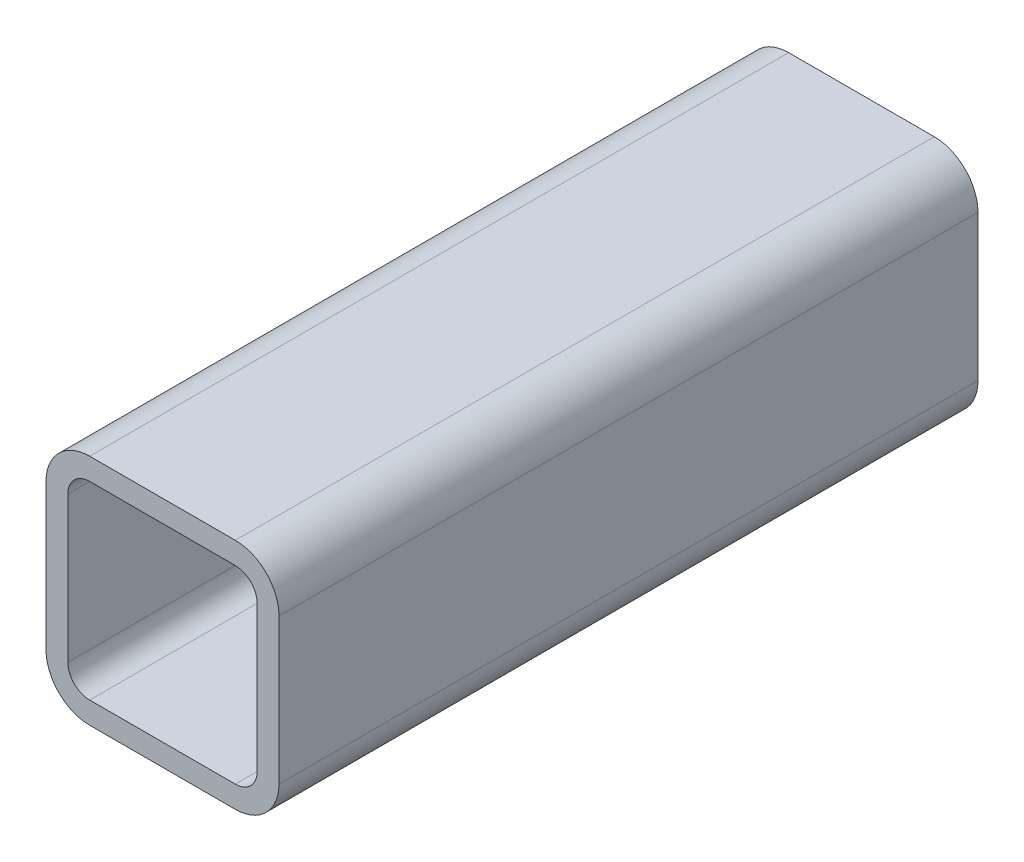
ISO-10303-21;
HEADER;
FILE_DESCRIPTION(('STEP AP214'),'2;1');
FILE_NAME('part.step','',(''),(''),'','','');
FILE_SCHEMA(('AUTOMOTIVE_DESIGN { 1 0 10303 214 1 1 1 1 }'));
ENDSEC;
DATA;
#1=APPLICATION_CONTEXT('core data for automotive mechanical design processes');
#2=APPLICATION_PROTOCOL_DEFINITION('international standard','automotive_design',2000,#1);
#3=PRODUCT_CONTEXT('',#1,'mechanical');
#4=PRODUCT('Part','Part','',(#3));
#5=PRODUCT_RELATED_PRODUCT_CATEGORY('part','',(#4));
#6=PRODUCT_DEFINITION_FORMATION('','',#4);
#7=PRODUCT_DEFINITION_CONTEXT('part definition',#1,'design');
#8=PRODUCT_DEFINITION('design','',#6,#7);
#9=PRODUCT_DEFINITION_SHAPE('','',#8);
#10=(LENGTH_UNIT() NAMED_UNIT(*) SI_UNIT(.MILLI.,.METRE.));
#11=(NAMED_UNIT(*) PLANE_ANGLE_UNIT() SI_UNIT($,.RADIAN.));
#12=(NAMED_UNIT(*) SI_UNIT($,.STERADIAN.) SOLID_ANGLE_UNIT());
#13=UNCERTAINTY_MEASURE_WITH_UNIT(LENGTH_MEASURE(1.E-05),#10,'distance_accuracy_value','');
#14=(GEOMETRIC_REPRESENTATION_CONTEXT(3) GLOBAL_UNCERTAINTY_ASSIGNED_CONTEXT((#13)) GLOBAL_UNIT_ASSIGNED_CONTEXT((#10,
#11,#12)) REPRESENTATION_CONTEXT('',''));
#15=CARTESIAN_POINT('',(0.,0.,0.));
#16=DIRECTION('',(0.,0.,1.));
#17=DIRECTION('',(1.,0.,0.));
#18=AXIS2_PLACEMENT_3D('',#15,#16,#17);
#19=CARTESIAN_POINT('',(41.27496425,41.27496425,76.2));
#20=DIRECTION('',(0.,0.,1.));
#21=DIRECTION('',(1.,0.,0.));
#22=AXIS2_PLACEMENT_3D('',#19,#20,#21);
#23=PLANE('',#22);
#24=CARTESIAN_POINT('',(41.27496425,41.27496425,76.2));
#25=DIRECTION('',(0.,0.,1.));
#26=DIRECTION('',(1.,0.,0.));
#27=AXIS2_PLACEMENT_3D('',#24,#25,#26);
#28=CIRCLE('',#27,9.52499175);
#29=CARTESIAN_POINT('',(50.799956,41.27496425,76.2));
#30=VERTEX_POINT('',#29);
#31=CARTESIAN_POINT('',(41.27496425,50.799956,76.2));
#32=VERTEX_POINT('',#31);
#33=EDGE_CURVE('E210',#30,#32,#28,.T.);
#34=ORIENTED_EDGE('',*,*,#33,.T.);
#35=DIRECTION('',(-1.,0.,0.));
#36=VECTOR('',#35,1.);
#37=CARTESIAN_POINT('',(41.27496425,50.799956,76.2));
#38=LINE('',#37,#36);
#39=CARTESIAN_POINT('',(9.52499174999999,50.799956,76.2));
#40=VERTEX_POINT('',#39);
#41=EDGE_CURVE('E213',#32,#40,#38,.T.);
#42=ORIENTED_EDGE('',*,*,#41,.T.);
#43=CARTESIAN_POINT('',(9.52499174999999,41.27496425,76.2));
#44=DIRECTION('',(0.,0.,1.));
#45=DIRECTION('',(1.,0.,0.));
#46=AXIS2_PLACEMENT_3D('',#43,#44,#45);
#47=CIRCLE('',#46,9.52499175);
#48=CARTESIAN_POINT('',(0.,41.27496425,76.2));
#49=VERTEX_POINT('',#48);
#50=EDGE_CURVE('E216',#40,#49,#47,.T.);
#51=ORIENTED_EDGE('',*,*,#50,.T.);
#52=DIRECTION('',(0.,-1.,0.));
#53=VECTOR('',#52,1.);
#54=CARTESIAN_POINT('',(0.,9.52499175,76.2));
#55=LINE('',#54,#53);
#56=CARTESIAN_POINT('',(0.,9.52499175,76.2));
#57=VERTEX_POINT('',#56);
#58=EDGE_CURVE('E218',#49,#57,#55,.T.);
#59=ORIENTED_EDGE('',*,*,#58,.T.);
#60=CARTESIAN_POINT('',(9.52499175,9.52499175,76.2));
#61=DIRECTION('',(0.,0.,1.));
#62=DIRECTION('',(1.,0.,0.));
#63=AXIS2_PLACEMENT_3D('',#60,#61,#62);
#64=CIRCLE('',#63,9.52499175);
#65=CARTESIAN_POINT('',(9.52499175,0.,76.2));
#66=VERTEX_POINT('',#65);
#67=EDGE_CURVE('E220',#57,#66,#64,.T.);
#68=ORIENTED_EDGE('',*,*,#67,.T.);
#69=DIRECTION('',(1.,0.,0.));
#70=VECTOR('',#69,1.);
#71=CARTESIAN_POINT('',(9.52499175,0.,76.2));
#72=LINE('',#71,#70);
#73=CARTESIAN_POINT('',(41.27496425,0.,76.2));
#74=VERTEX_POINT('',#73);
#75=EDGE_CURVE('E222',#66,#74,#72,.T.);
#76=ORIENTED_EDGE('',*,*,#75,.T.);
#77=CARTESIAN_POINT('',(41.27496425,9.52499175,76.2));
#78=DIRECTION('',(0.,0.,1.));
#79=DIRECTION('',(1.,0.,0.));
#80=AXIS2_PLACEMENT_3D('',#77,#78,#79);
#81=CIRCLE('',#80,9.52499175);
#82=CARTESIAN_POINT('',(50.799956,9.52499175,76.2));
#83=VERTEX_POINT('',#82);
#84=EDGE_CURVE('E224',#74,#83,#81,.T.);
#85=ORIENTED_EDGE('',*,*,#84,.T.);
#86=DIRECTION('',(0.,1.,0.));
#87=VECTOR('',#86,1.);
#88=CARTESIAN_POINT('',(50.799956,41.27496425,76.2));
#89=LINE('',#88,#87);
#90=EDGE_CURVE('E226',#83,#30,#89,.T.);
#91=ORIENTED_EDGE('',*,*,#90,.T.);
#92=EDGE_LOOP('',(#34,#42,#51,#59,#68,#76,#85,#91));
#93=FACE_BOUND('',#92,.T.);
#94=DIRECTION('',(0.,-1.,0.));
#95=VECTOR('',#94,1.);
#96=CARTESIAN_POINT('',(4.762495875,9.52499175,76.2));
#97=LINE('',#96,#95);
#98=CARTESIAN_POINT('',(4.76249587499999,41.27496425,76.2));
#99=VERTEX_POINT('',#98);
#100=CARTESIAN_POINT('',(4.762495875,9.52499175,76.2));
#101=VERTEX_POINT('',#100);
#102=EDGE_CURVE('E153',#99,#101,#97,.T.);
#103=ORIENTED_EDGE('',*,*,#102,.F.);
#104=CARTESIAN_POINT('',(9.52499174999999,41.27496425,76.2));
#105=DIRECTION('',(0.,0.,1.));
#106=DIRECTION('',(1.,0.,0.));
#107=AXIS2_PLACEMENT_3D('',#104,#105,#106);
#108=CIRCLE('',#107,4.762495875);
#109=CARTESIAN_POINT('',(9.52499174999999,46.037460125,76.2));
#110=VERTEX_POINT('',#109);
#111=EDGE_CURVE('E145',#110,#99,#108,.T.);
#112=ORIENTED_EDGE('',*,*,#111,.F.);
#113=DIRECTION('',(-1.,0.,0.));
#114=VECTOR('',#113,1.);
#115=CARTESIAN_POINT('',(41.27496425,46.037460125,76.2));
#116=LINE('',#115,#114);
#117=CARTESIAN_POINT('',(41.27496425,46.037460125,76.2));
#118=VERTEX_POINT('',#117);
#119=EDGE_CURVE('E178',#118,#110,#116,.T.);
#120=ORIENTED_EDGE('',*,*,#119,.F.);
#121=CARTESIAN_POINT('',(41.27496425,41.27496425,76.2));
#122=DIRECTION('',(0.,0.,1.));
#123=DIRECTION('',(1.,0.,0.));
#124=AXIS2_PLACEMENT_3D('',#121,#122,#123);
#125=CIRCLE('',#124,4.76249587500001);
#126=CARTESIAN_POINT('',(46.037460125,41.27496425,76.2));
#127=VERTEX_POINT('',#126);
#128=EDGE_CURVE('E176',#127,#118,#125,.T.);
#129=ORIENTED_EDGE('',*,*,#128,.F.);
#130=DIRECTION('',(0.,1.,0.));
#131=VECTOR('',#130,1.);
#132=CARTESIAN_POINT('',(46.037460125,41.27496425,76.2));
#133=LINE('',#132,#131);
#134=CARTESIAN_POINT('',(46.037460125,9.52499175,76.2));
#135=VERTEX_POINT('',#134);
#136=EDGE_CURVE('E174',#135,#127,#133,.T.);
#137=ORIENTED_EDGE('',*,*,#136,.F.);
#138=CARTESIAN_POINT('',(41.27496425,9.52499175,76.2));
#139=DIRECTION('',(0.,0.,1.));
#140=DIRECTION('',(1.,0.,0.));
#141=AXIS2_PLACEMENT_3D('',#138,#139,#140);
#142=CIRCLE('',#141,4.762495875);
#143=CARTESIAN_POINT('',(41.27496425,4.762495875,76.2));
#144=VERTEX_POINT('',#143);
#145=EDGE_CURVE('E172',#144,#135,#142,.T.);
#146=ORIENTED_EDGE('',*,*,#145,.F.);
#147=DIRECTION('',(1.,0.,0.));
#148=VECTOR('',#147,1.);
#149=CARTESIAN_POINT('',(9.52499175,4.762495875,76.2));
#150=LINE('',#149,#148);
#151=CARTESIAN_POINT('',(9.52499175,4.762495875,76.2));
#152=VERTEX_POINT('',#151);
#153=EDGE_CURVE('E168',#152,#144,#150,.T.);
#154=ORIENTED_EDGE('',*,*,#153,.F.);
#155=CARTESIAN_POINT('',(9.52499175,9.52499175,76.2));
#156=DIRECTION('',(0.,0.,1.));
#157=DIRECTION('',(1.,0.,0.));
#158=AXIS2_PLACEMENT_3D('',#155,#156,#157);
#159=CIRCLE('',#158,4.762495875);
#160=EDGE_CURVE('E166',#101,#152,#159,.T.);
#161=ORIENTED_EDGE('',*,*,#160,.F.);
#162=EDGE_LOOP('',(#103,#112,#120,#129,#137,#146,#154,#161));
#163=FACE_BOUND('',#162,.T.);
#164=ADVANCED_FACE('F32',(#93,#163),#23,.T.);
#165=CARTESIAN_POINT('',(41.27496425,41.27496425,-76.2));
#166=DIRECTION('',(0.,0.,1.));
#167=DIRECTION('',(1.,0.,0.));
#168=AXIS2_PLACEMENT_3D('',#165,#166,#167);
#169=PLANE('',#168);
#170=CARTESIAN_POINT('',(41.27496425,41.27496425,-76.2));
#171=DIRECTION('',(0.,0.,1.));
#172=DIRECTION('',(1.,0.,0.));
#173=AXIS2_PLACEMENT_3D('',#170,#171,#172);
#174=CIRCLE('',#173,9.52499175);
#175=CARTESIAN_POINT('',(50.799956,41.27496425,-76.2));
#176=VERTEX_POINT('',#175);
#177=CARTESIAN_POINT('',(41.27496425,50.799956,-76.2));
#178=VERTEX_POINT('',#177);
#179=EDGE_CURVE('E161',#176,#178,#174,.T.);
#180=ORIENTED_EDGE('',*,*,#179,.F.);
#181=DIRECTION('',(0.,1.,0.));
#182=VECTOR('',#181,1.);
#183=CARTESIAN_POINT('',(50.799956,41.27496425,-76.2));
#184=LINE('',#183,#182);
#185=CARTESIAN_POINT('',(50.799956,9.52499175,-76.2));
#186=VERTEX_POINT('',#185);
#187=EDGE_CURVE('E214',#186,#176,#184,.T.);
#188=ORIENTED_EDGE('',*,*,#187,.F.);
#189=CARTESIAN_POINT('',(41.27496425,9.52499175,-76.2));
#190=DIRECTION('',(0.,0.,1.));
#191=DIRECTION('',(1.,0.,0.));
#192=AXIS2_PLACEMENT_3D('',#189,#190,#191);
#193=CIRCLE('',#192,9.52499175);
#194=CARTESIAN_POINT('',(41.27496425,0.,-76.2));
#195=VERTEX_POINT('',#194);
#196=EDGE_CURVE('E241',#195,#186,#193,.T.);
#197=ORIENTED_EDGE('',*,*,#196,.F.);
#198=DIRECTION('',(1.,0.,0.));
#199=VECTOR('',#198,1.);
#200=CARTESIAN_POINT('',(9.52499175,0.,-76.2));
#201=LINE('',#200,#199);
#202=CARTESIAN_POINT('',(9.52499175,0.,-76.2));
#203=VERTEX_POINT('',#202);
#204=EDGE_CURVE('E239',#203,#195,#201,.T.);
#205=ORIENTED_EDGE('',*,*,#204,.F.);
#206=CARTESIAN_POINT('',(9.52499175,9.52499175,-76.2));
#207=DIRECTION('',(0.,0.,1.));
#208=DIRECTION('',(1.,0.,0.));
#209=AXIS2_PLACEMENT_3D('',#206,#207,#208);
#210=CIRCLE('',#209,9.52499175);
#211=CARTESIAN_POINT('',(0.,9.52499175,-76.2));
#212=VERTEX_POINT('',#211);
#213=EDGE_CURVE('E237',#212,#203,#210,.T.);
#214=ORIENTED_EDGE('',*,*,#213,.F.);
#215=DIRECTION('',(0.,-1.,0.));
#216=VECTOR('',#215,1.);
#217=CARTESIAN_POINT('',(0.,9.52499175,-76.2));
#218=LINE('',#217,#216);
#219=CARTESIAN_POINT('',(0.,41.27496425,-76.2));
#220=VERTEX_POINT('',#219);
#221=EDGE_CURVE('E235',#220,#212,#218,.T.);
#222=ORIENTED_EDGE('',*,*,#221,.F.);
#223=CARTESIAN_POINT('',(9.52499174999999,41.27496425,-76.2));
#224=DIRECTION('',(0.,0.,1.));
#225=DIRECTION('',(1.,0.,0.));
#226=AXIS2_PLACEMENT_3D('',#223,#224,#225);
#227=CIRCLE('',#226,9.52499175);
#228=CARTESIAN_POINT('',(9.52499174999999,50.799956,-76.2));
#229=VERTEX_POINT('',#228);
#230=EDGE_CURVE('E233',#229,#220,#227,.T.);
#231=ORIENTED_EDGE('',*,*,#230,.F.);
#232=DIRECTION('',(-1.,0.,0.));
#233=VECTOR('',#232,1.);
#234=CARTESIAN_POINT('',(41.27496425,50.799956,-76.2));
#235=LINE('',#234,#233);
#236=EDGE_CURVE('E231',#178,#229,#235,.T.);
#237=ORIENTED_EDGE('',*,*,#236,.F.);
#238=EDGE_LOOP('',(#180,#188,#197,#205,#214,#222,#231,#237));
#239=FACE_BOUND('',#238,.T.);
#240=CARTESIAN_POINT('',(9.52499174999999,41.27496425,-76.2));
#241=DIRECTION('',(0.,0.,1.));
#242=DIRECTION('',(1.,0.,0.));
#243=AXIS2_PLACEMENT_3D('',#240,#241,#242);
#244=CIRCLE('',#243,4.762495875);
#245=CARTESIAN_POINT('',(9.52499175,46.037460125,-76.2));
#246=VERTEX_POINT('',#245);
#247=CARTESIAN_POINT('',(4.76249587499999,41.27496425,-76.2));
#248=VERTEX_POINT('',#247);
#249=EDGE_CURVE('E55',#246,#248,#244,.T.);
#250=ORIENTED_EDGE('',*,*,#249,.T.);
#251=DIRECTION('',(0.,-1.,0.));
#252=VECTOR('',#251,1.);
#253=CARTESIAN_POINT('',(4.762495875,9.52499175,-76.2));
#254=LINE('',#253,#252);
#255=CARTESIAN_POINT('',(4.762495875,9.52499175,-76.2));
#256=VERTEX_POINT('',#255);
#257=EDGE_CURVE('E160',#248,#256,#254,.T.);
#258=ORIENTED_EDGE('',*,*,#257,.T.);
#259=CARTESIAN_POINT('',(9.52499175,9.52499175,-76.2));
#260=DIRECTION('',(0.,0.,1.));
#261=DIRECTION('',(1.,0.,0.));
#262=AXIS2_PLACEMENT_3D('',#259,#260,#261);
#263=CIRCLE('',#262,4.762495875);
#264=CARTESIAN_POINT('',(9.52499175,4.762495875,-76.2));
#265=VERTEX_POINT('',#264);
#266=EDGE_CURVE('E182',#256,#265,#263,.T.);
#267=ORIENTED_EDGE('',*,*,#266,.T.);
#268=DIRECTION('',(1.,0.,0.));
#269=VECTOR('',#268,1.);
#270=CARTESIAN_POINT('',(9.52499175,4.762495875,-76.2));
#271=LINE('',#270,#269);
#272=CARTESIAN_POINT('',(41.27496425,4.762495875,-76.2));
#273=VERTEX_POINT('',#272);
#274=EDGE_CURVE('E185',#265,#273,#271,.T.);
#275=ORIENTED_EDGE('',*,*,#274,.T.);
#276=CARTESIAN_POINT('',(41.27496425,9.52499175,-76.2));
#277=DIRECTION('',(0.,0.,1.));
#278=DIRECTION('',(1.,0.,0.));
#279=AXIS2_PLACEMENT_3D('',#276,#277,#278);
#280=CIRCLE('',#279,4.762495875);
#281=CARTESIAN_POINT('',(46.037460125,9.52499175,-76.2));
#282=VERTEX_POINT('',#281);
#283=EDGE_CURVE('E188',#273,#282,#280,.T.);
#284=ORIENTED_EDGE('',*,*,#283,.T.);
#285=DIRECTION('',(0.,1.,0.));
#286=VECTOR('',#285,1.);
#287=CARTESIAN_POINT('',(46.037460125,41.27496425,-76.2));
#288=LINE('',#287,#286);
#289=CARTESIAN_POINT('',(46.037460125,41.27496425,-76.2));
#290=VERTEX_POINT('',#289);
#291=EDGE_CURVE('E191',#282,#290,#288,.T.);
#292=ORIENTED_EDGE('',*,*,#291,.T.);
#293=CARTESIAN_POINT('',(41.27496425,41.27496425,-76.2));
#294=DIRECTION('',(0.,0.,1.));
#295=DIRECTION('',(1.,0.,0.));
#296=AXIS2_PLACEMENT_3D('',#293,#294,#295);
#297=CIRCLE('',#296,4.76249587500001);
#298=CARTESIAN_POINT('',(41.27496425,46.037460125,-76.2));
#299=VERTEX_POINT('',#298);
#300=EDGE_CURVE('E194',#290,#299,#297,.T.);
#301=ORIENTED_EDGE('',*,*,#300,.T.);
#302=DIRECTION('',(-1.,0.,0.));
#303=VECTOR('',#302,1.);
#304=CARTESIAN_POINT('',(41.27496425,46.037460125,-76.2));
#305=LINE('',#304,#303);
#306=EDGE_CURVE('E154',#299,#246,#305,.T.);
#307=ORIENTED_EDGE('',*,*,#306,.T.);
#308=EDGE_LOOP('',(#250,#258,#267,#275,#284,#292,#301,#307));
#309=FACE_BOUND('',#308,.T.);
#310=ADVANCED_FACE('F271',(#239,#309),#169,.F.);
#311=CARTESIAN_POINT('',(41.27496425,41.27496425,76.2));
#312=DIRECTION('',(0.,0.,-1.));
#313=DIRECTION('',(-1.,0.,0.));
#314=AXIS2_PLACEMENT_3D('',#311,#312,#313);
#315=CYLINDRICAL_SURFACE('',#314,9.52499175);
#316=ORIENTED_EDGE('',*,*,#179,.T.);
#317=DIRECTION('',(0.,0.,-1.));
#318=VECTOR('',#317,1.);
#319=CARTESIAN_POINT('',(41.27496425,50.799956,76.2));
#320=LINE('',#319,#318);
#321=EDGE_CURVE('E11',#32,#178,#320,.T.);
#322=ORIENTED_EDGE('',*,*,#321,.F.);
#323=ORIENTED_EDGE('',*,*,#33,.F.);
#324=DIRECTION('',(0.,0.,-1.));
#325=VECTOR('',#324,1.);
#326=CARTESIAN_POINT('',(50.799956,41.27496425,76.2));
#327=LINE('',#326,#325);
#328=EDGE_CURVE('E228',#30,#176,#327,.T.);
#329=ORIENTED_EDGE('',*,*,#328,.T.);
#330=EDGE_LOOP('',(#316,#322,#323,#329));
#331=FACE_BOUND('',#330,.T.);
#332=ADVANCED_FACE('F34',(#331),#315,.T.);
#333=CARTESIAN_POINT('',(41.27496425,50.799956,76.2));
#334=DIRECTION('',(0.,-1.,0.));
#335=DIRECTION('',(0.,0.,-1.));
#336=AXIS2_PLACEMENT_3D('',#333,#334,#335);
#337=PLANE('',#336);
#338=ORIENTED_EDGE('',*,*,#236,.T.);
#339=DIRECTION('',(0.,0.,-1.));
#340=VECTOR('',#339,1.);
#341=CARTESIAN_POINT('',(9.52499174999999,50.799956,76.2));
#342=LINE('',#341,#340);
#343=EDGE_CURVE('E40',#40,#229,#342,.T.);
#344=ORIENTED_EDGE('',*,*,#343,.F.);
#345=ORIENTED_EDGE('',*,*,#41,.F.);
#346=ORIENTED_EDGE('',*,*,#321,.T.);
#347=EDGE_LOOP('',(#338,#344,#345,#346));
#348=FACE_BOUND('',#347,.T.);
#349=ADVANCED_FACE('F288',(#348),#337,.F.);
#350=CARTESIAN_POINT('',(9.52499174999999,41.27496425,76.2));
#351=DIRECTION('',(0.,0.,-1.));
#352=DIRECTION('',(-1.,0.,0.));
#353=AXIS2_PLACEMENT_3D('',#350,#351,#352);
#354=CYLINDRICAL_SURFACE('',#353,9.52499175);
#355=ORIENTED_EDGE('',*,*,#230,.T.);
#356=DIRECTION('',(0.,0.,-1.));
#357=VECTOR('',#356,1.);
#358=CARTESIAN_POINT('',(0.,41.27496425,76.2));
#359=LINE('',#358,#357);
#360=EDGE_CURVE('E258',#49,#220,#359,.T.);
#361=ORIENTED_EDGE('',*,*,#360,.F.);
#362=ORIENTED_EDGE('',*,*,#50,.F.);
#363=ORIENTED_EDGE('',*,*,#343,.T.);
#364=EDGE_LOOP('',(#355,#361,#362,#363));
#365=FACE_BOUND('',#364,.T.);
#366=ADVANCED_FACE('F265',(#365),#354,.T.);
#367=CARTESIAN_POINT('',(0.,9.52499175,76.2));
#368=DIRECTION('',(1.,0.,0.));
#369=DIRECTION('',(0.,1.,0.));
#370=AXIS2_PLACEMENT_3D('',#367,#368,#369);
#371=PLANE('',#370);
#372=ORIENTED_EDGE('',*,*,#221,.T.);
#373=DIRECTION('',(0.,0.,-1.));
#374=VECTOR('',#373,1.);
#375=CARTESIAN_POINT('',(0.,9.52499175,76.2));
#376=LINE('',#375,#374);
#377=EDGE_CURVE('E255',#57,#212,#376,.T.);
#378=ORIENTED_EDGE('',*,*,#377,.F.);
#379=ORIENTED_EDGE('',*,*,#58,.F.);
#380=ORIENTED_EDGE('',*,*,#360,.T.);
#381=EDGE_LOOP('',(#372,#378,#379,#380));
#382=FACE_BOUND('',#381,.T.);
#383=ADVANCED_FACE('F277',(#382),#371,.F.);
#384=CARTESIAN_POINT('',(9.52499175,9.52499175,76.2));
#385=DIRECTION('',(0.,0.,-1.));
#386=DIRECTION('',(-1.,0.,0.));
#387=AXIS2_PLACEMENT_3D('',#384,#385,#386);
#388=CYLINDRICAL_SURFACE('',#387,9.52499175);
#389=ORIENTED_EDGE('',*,*,#213,.T.);
#390=DIRECTION('',(0.,0.,-1.));
#391=VECTOR('',#390,1.);
#392=CARTESIAN_POINT('',(9.52499175,0.,76.2));
#393=LINE('',#392,#391);
#394=EDGE_CURVE('E252',#66,#203,#393,.T.);
#395=ORIENTED_EDGE('',*,*,#394,.F.);
#396=ORIENTED_EDGE('',*,*,#67,.F.);
#397=ORIENTED_EDGE('',*,*,#377,.T.);
#398=EDGE_LOOP('',(#389,#395,#396,#397));
#399=FACE_BOUND('',#398,.T.);
#400=ADVANCED_FACE('F281',(#399),#388,.T.);
#401=CARTESIAN_POINT('',(9.52499175,0.,76.2));
#402=DIRECTION('',(0.,1.,0.));
#403=DIRECTION('',(0.,0.,1.));
#404=AXIS2_PLACEMENT_3D('',#401,#402,#403);
#405=PLANE('',#404);
#406=ORIENTED_EDGE('',*,*,#204,.T.);
#407=DIRECTION('',(0.,0.,-1.));
#408=VECTOR('',#407,1.);
#409=CARTESIAN_POINT('',(41.27496425,0.,76.2));
#410=LINE('',#409,#408);
#411=EDGE_CURVE('E249',#74,#195,#410,.T.);
#412=ORIENTED_EDGE('',*,*,#411,.F.);
#413=ORIENTED_EDGE('',*,*,#75,.F.);
#414=ORIENTED_EDGE('',*,*,#394,.T.);
#415=EDGE_LOOP('',(#406,#412,#413,#414));
#416=FACE_BOUND('',#415,.T.);
#417=ADVANCED_FACE('F301',(#416),#405,.F.);
#418=CARTESIAN_POINT('',(41.27496425,9.52499175,76.2));
#419=DIRECTION('',(0.,0.,-1.));
#420=DIRECTION('',(-1.,0.,0.));
#421=AXIS2_PLACEMENT_3D('',#418,#419,#420);
#422=CYLINDRICAL_SURFACE('',#421,9.52499175);
#423=ORIENTED_EDGE('',*,*,#196,.T.);
#424=DIRECTION('',(0.,0.,-1.));
#425=VECTOR('',#424,1.);
#426=CARTESIAN_POINT('',(50.799956,9.52499175,76.2));
#427=LINE('',#426,#425);
#428=EDGE_CURVE('E246',#83,#186,#427,.T.);
#429=ORIENTED_EDGE('',*,*,#428,.F.);
#430=ORIENTED_EDGE('',*,*,#84,.F.);
#431=ORIENTED_EDGE('',*,*,#411,.T.);
#432=EDGE_LOOP('',(#423,#429,#430,#431));
#433=FACE_BOUND('',#432,.T.);
#434=ADVANCED_FACE('F299',(#433),#422,.T.);
#435=CARTESIAN_POINT('',(50.799956,41.27496425,76.2));
#436=DIRECTION('',(-1.,0.,0.));
#437=DIRECTION('',(0.,-1.,0.));
#438=AXIS2_PLACEMENT_3D('',#435,#436,#437);
#439=PLANE('',#438);
#440=ORIENTED_EDGE('',*,*,#187,.T.);
#441=ORIENTED_EDGE('',*,*,#328,.F.);
#442=ORIENTED_EDGE('',*,*,#90,.F.);
#443=ORIENTED_EDGE('',*,*,#428,.T.);
#444=EDGE_LOOP('',(#440,#441,#442,#443));
#445=FACE_BOUND('',#444,.T.);
#446=ADVANCED_FACE('F294',(#445),#439,.F.);
#447=CARTESIAN_POINT('',(9.52499174999999,41.27496425,76.2));
#448=DIRECTION('',(0.,0.,-1.));
#449=DIRECTION('',(-1.,0.,0.));
#450=AXIS2_PLACEMENT_3D('',#447,#448,#449);
#451=CYLINDRICAL_SURFACE('',#450,4.762495875);
#452=ORIENTED_EDGE('',*,*,#249,.F.);
#453=DIRECTION('',(0.,0.,-1.));
#454=VECTOR('',#453,1.);
#455=CARTESIAN_POINT('',(9.52499174999999,46.037460125,76.2));
#456=LINE('',#455,#454);
#457=EDGE_CURVE('E149',#110,#246,#456,.T.);
#458=ORIENTED_EDGE('',*,*,#457,.F.);
#459=ORIENTED_EDGE('',*,*,#111,.T.);
#460=DIRECTION('',(0.,0.,-1.));
#461=VECTOR('',#460,1.);
#462=CARTESIAN_POINT('',(4.76249587499999,41.27496425,76.2));
#463=LINE('',#462,#461);
#464=EDGE_CURVE('E148',#99,#248,#463,.T.);
#465=ORIENTED_EDGE('',*,*,#464,.T.);
#466=EDGE_LOOP('',(#452,#458,#459,#465));
#467=FACE_BOUND('',#466,.T.);
#468=ADVANCED_FACE('F147',(#467),#451,.F.);
#469=CARTESIAN_POINT('',(4.762495875,9.52499175,76.2));
#470=DIRECTION('',(1.,0.,0.));
#471=DIRECTION('',(0.,1.,0.));
#472=AXIS2_PLACEMENT_3D('',#469,#470,#471);
#473=PLANE('',#472);
#474=ORIENTED_EDGE('',*,*,#257,.F.);
#475=ORIENTED_EDGE('',*,*,#464,.F.);
#476=ORIENTED_EDGE('',*,*,#102,.T.);
#477=DIRECTION('',(0.,0.,-1.));
#478=VECTOR('',#477,1.);
#479=CARTESIAN_POINT('',(4.762495875,9.52499175,76.2));
#480=LINE('',#479,#478);
#481=EDGE_CURVE('E162',#101,#256,#480,.T.);
#482=ORIENTED_EDGE('',*,*,#481,.T.);
#483=EDGE_LOOP('',(#474,#475,#476,#482));
#484=FACE_BOUND('',#483,.T.);
#485=ADVANCED_FACE('F157',(#484),#473,.T.);
#486=CARTESIAN_POINT('',(9.52499175,9.52499175,76.2));
#487=DIRECTION('',(0.,0.,-1.));
#488=DIRECTION('',(-1.,0.,0.));
#489=AXIS2_PLACEMENT_3D('',#486,#487,#488);
#490=CYLINDRICAL_SURFACE('',#489,4.762495875);
#491=ORIENTED_EDGE('',*,*,#266,.F.);
#492=ORIENTED_EDGE('',*,*,#481,.F.);
#493=ORIENTED_EDGE('',*,*,#160,.T.);
#494=DIRECTION('',(0.,0.,-1.));
#495=VECTOR('',#494,1.);
#496=CARTESIAN_POINT('',(9.52499175,4.762495875,76.2));
#497=LINE('',#496,#495);
#498=EDGE_CURVE('E207',#152,#265,#497,.T.);
#499=ORIENTED_EDGE('',*,*,#498,.T.);
#500=EDGE_LOOP('',(#491,#492,#493,#499));
#501=FACE_BOUND('',#500,.T.);
#502=ADVANCED_FACE('F326',(#501),#490,.F.);
#503=CARTESIAN_POINT('',(9.52499175,4.762495875,76.2));
#504=DIRECTION('',(0.,1.,0.));
#505=DIRECTION('',(0.,0.,1.));
#506=AXIS2_PLACEMENT_3D('',#503,#504,#505);
#507=PLANE('',#506);
#508=ORIENTED_EDGE('',*,*,#274,.F.);
#509=ORIENTED_EDGE('',*,*,#498,.F.);
#510=ORIENTED_EDGE('',*,*,#153,.T.);
#511=DIRECTION('',(0.,0.,-1.));
#512=VECTOR('',#511,1.);
#513=CARTESIAN_POINT('',(41.27496425,4.762495875,76.2));
#514=LINE('',#513,#512);
#515=EDGE_CURVE('E205',#144,#273,#514,.T.);
#516=ORIENTED_EDGE('',*,*,#515,.T.);
#517=EDGE_LOOP('',(#508,#509,#510,#516));
#518=FACE_BOUND('',#517,.T.);
#519=ADVANCED_FACE('F330',(#518),#507,.T.);
#520=CARTESIAN_POINT('',(41.27496425,9.52499175,76.2));
#521=DIRECTION('',(0.,0.,-1.));
#522=DIRECTION('',(-1.,0.,0.));
#523=AXIS2_PLACEMENT_3D('',#520,#521,#522);
#524=CYLINDRICAL_SURFACE('',#523,4.762495875);
#525=ORIENTED_EDGE('',*,*,#283,.F.);
#526=ORIENTED_EDGE('',*,*,#515,.F.);
#527=ORIENTED_EDGE('',*,*,#145,.T.);
#528=DIRECTION('',(0.,0.,-1.));
#529=VECTOR('',#528,1.);
#530=CARTESIAN_POINT('',(46.037460125,9.52499175,76.2));
#531=LINE('',#530,#529);
#532=EDGE_CURVE('E203',#135,#282,#531,.T.);
#533=ORIENTED_EDGE('',*,*,#532,.T.);
#534=EDGE_LOOP('',(#525,#526,#527,#533));
#535=FACE_BOUND('',#534,.T.);
#536=ADVANCED_FACE('F336',(#535),#524,.F.);
#537=CARTESIAN_POINT('',(46.037460125,41.27496425,76.2));
#538=DIRECTION('',(-1.,0.,0.));
#539=DIRECTION('',(0.,-1.,0.));
#540=AXIS2_PLACEMENT_3D('',#537,#538,#539);
#541=PLANE('',#540);
#542=ORIENTED_EDGE('',*,*,#291,.F.);
#543=ORIENTED_EDGE('',*,*,#532,.F.);
#544=ORIENTED_EDGE('',*,*,#136,.T.);
#545=DIRECTION('',(0.,0.,-1.));
#546=VECTOR('',#545,1.);
#547=CARTESIAN_POINT('',(46.037460125,41.27496425,76.2));
#548=LINE('',#547,#546);
#549=EDGE_CURVE('E201',#127,#290,#548,.T.);
#550=ORIENTED_EDGE('',*,*,#549,.T.);
#551=EDGE_LOOP('',(#542,#543,#544,#550));
#552=FACE_BOUND('',#551,.T.);
#553=ADVANCED_FACE('F340',(#552),#541,.T.);
#554=CARTESIAN_POINT('',(41.27496425,41.27496425,76.2));
#555=DIRECTION('',(0.,0.,-1.));
#556=DIRECTION('',(-1.,0.,0.));
#557=AXIS2_PLACEMENT_3D('',#554,#555,#556);
#558=CYLINDRICAL_SURFACE('',#557,4.76249587500001);
#559=ORIENTED_EDGE('',*,*,#300,.F.);
#560=ORIENTED_EDGE('',*,*,#549,.F.);
#561=ORIENTED_EDGE('',*,*,#128,.T.);
#562=DIRECTION('',(0.,0.,-1.));
#563=VECTOR('',#562,1.);
#564=CARTESIAN_POINT('',(41.27496425,46.037460125,76.2));
#565=LINE('',#564,#563);
#566=EDGE_CURVE('E47',#118,#299,#565,.T.);
#567=ORIENTED_EDGE('',*,*,#566,.T.);
#568=EDGE_LOOP('',(#559,#560,#561,#567));
#569=FACE_BOUND('',#568,.T.);
#570=ADVANCED_FACE('F344',(#569),#558,.F.);
#571=CARTESIAN_POINT('',(41.27496425,46.037460125,76.2));
#572=DIRECTION('',(0.,-1.,0.));
#573=DIRECTION('',(1.,0.,0.));
#574=AXIS2_PLACEMENT_3D('',#571,#572,#573);
#575=PLANE('',#574);
#576=ORIENTED_EDGE('',*,*,#306,.F.);
#577=ORIENTED_EDGE('',*,*,#566,.F.);
#578=ORIENTED_EDGE('',*,*,#119,.T.);
#579=ORIENTED_EDGE('',*,*,#457,.T.);
#580=EDGE_LOOP('',(#576,#577,#578,#579));
#581=FACE_BOUND('',#580,.T.);
#582=ADVANCED_FACE('F348',(#581),#575,.T.);
#583=CLOSED_SHELL('',(#164,#310,#332,#349,#366,#383,#400,#417,#434,#446,#468,#485,#502,#519,
#536,#553,#570,#582));
#584=MANIFOLD_SOLID_BREP('B2',#583);
#585=ADVANCED_BREP_SHAPE_REPRESENTATION('',(#18,#584),#14);
#586=SHAPE_DEFINITION_REPRESENTATION(#9,#585);
ENDSEC;
END-ISO-10303-21;
